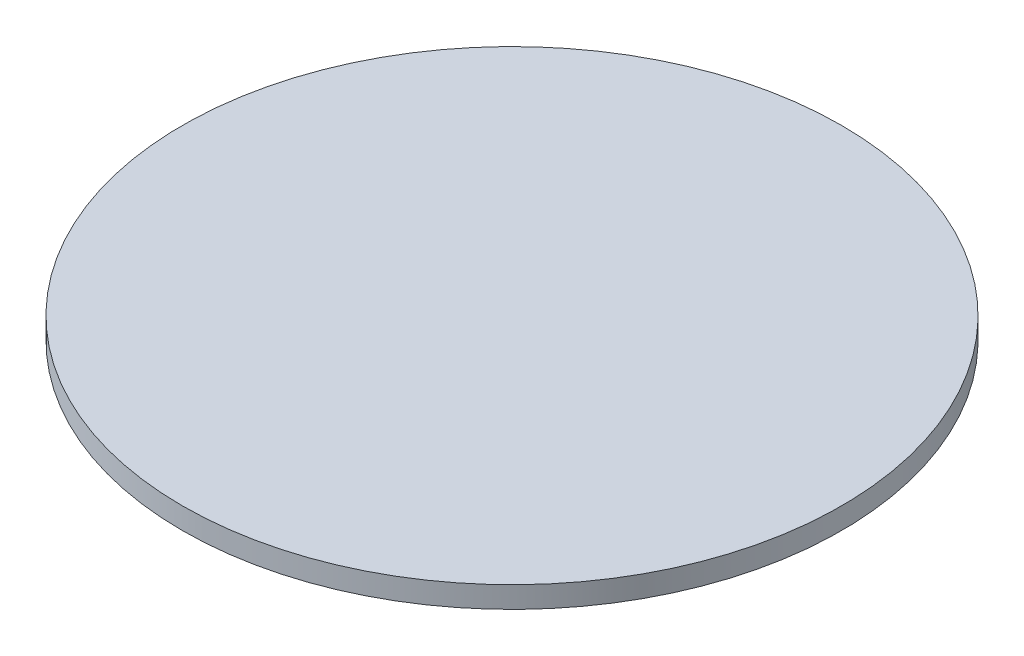
ISO-10303-21;
HEADER;
FILE_DESCRIPTION(('STEP AP214'),'2;1');
FILE_NAME('part.step','',(''),(''),'','','');
FILE_SCHEMA(('AUTOMOTIVE_DESIGN { 1 0 10303 214 1 1 1 1 }'));
ENDSEC;
DATA;
#1=APPLICATION_CONTEXT('core data for automotive mechanical design processes');
#2=APPLICATION_PROTOCOL_DEFINITION('international standard','automotive_design',2000,#1);
#3=PRODUCT_CONTEXT('',#1,'mechanical');
#4=PRODUCT('Part','Part','',(#3));
#5=PRODUCT_RELATED_PRODUCT_CATEGORY('part','',(#4));
#6=PRODUCT_DEFINITION_FORMATION('','',#4);
#7=PRODUCT_DEFINITION_CONTEXT('part definition',#1,'design');
#8=PRODUCT_DEFINITION('design','',#6,#7);
#9=PRODUCT_DEFINITION_SHAPE('','',#8);
#10=(LENGTH_UNIT() NAMED_UNIT(*) SI_UNIT(.MILLI.,.METRE.));
#11=(NAMED_UNIT(*) PLANE_ANGLE_UNIT() SI_UNIT($,.RADIAN.));
#12=(NAMED_UNIT(*) SI_UNIT($,.STERADIAN.) SOLID_ANGLE_UNIT());
#13=UNCERTAINTY_MEASURE_WITH_UNIT(LENGTH_MEASURE(1.E-05),#10,'distance_accuracy_value','');
#14=(GEOMETRIC_REPRESENTATION_CONTEXT(3) GLOBAL_UNCERTAINTY_ASSIGNED_CONTEXT((#13)) GLOBAL_UNIT_ASSIGNED_CONTEXT((#10,
#11,#12)) REPRESENTATION_CONTEXT('',''));
#15=CARTESIAN_POINT('',(0.,0.,0.));
#16=DIRECTION('',(0.,0.,1.));
#17=DIRECTION('',(1.,0.,0.));
#18=AXIS2_PLACEMENT_3D('',#15,#16,#17);
#19=CARTESIAN_POINT('',(0.,9.906,0.));
#20=DIRECTION('',(0.,-1.,0.));
#21=DIRECTION('',(0.,0.,-1.));
#22=AXIS2_PLACEMENT_3D('',#19,#20,#21);
#23=CYLINDRICAL_SURFACE('',#22,152.4);
#24=CARTESIAN_POINT('',(0.,9.906,0.));
#25=DIRECTION('',(0.,1.,0.));
#26=DIRECTION('',(0.,0.,1.));
#27=AXIS2_PLACEMENT_3D('',#24,#25,#26);
#28=CIRCLE('',#27,152.4);
#29=CARTESIAN_POINT('',(0.,9.906,152.4));
#30=VERTEX_POINT('',#29);
#31=EDGE_CURVE('E10',#30,#30,#28,.T.);
#32=ORIENTED_EDGE('',*,*,#31,.F.);
#33=EDGE_LOOP('',(#32));
#34=FACE_BOUND('',#33,.T.);
#35=CARTESIAN_POINT('',(0.,0.,0.));
#36=DIRECTION('',(0.,1.,0.));
#37=DIRECTION('',(0.,0.,1.));
#38=AXIS2_PLACEMENT_3D('',#35,#36,#37);
#39=CIRCLE('',#38,152.4);
#40=CARTESIAN_POINT('',(0.,0.,152.4));
#41=VERTEX_POINT('',#40);
#42=EDGE_CURVE('E40',#41,#41,#39,.T.);
#43=ORIENTED_EDGE('',*,*,#42,.T.);
#44=EDGE_LOOP('',(#43));
#45=FACE_BOUND('',#44,.T.);
#46=ADVANCED_FACE('F37',(#34,#45),#23,.T.);
#47=CARTESIAN_POINT('',(0.,9.906,0.));
#48=DIRECTION('',(0.,1.,0.));
#49=DIRECTION('',(0.,0.,1.));
#50=AXIS2_PLACEMENT_3D('',#47,#48,#49);
#51=PLANE('',#50);
#52=ORIENTED_EDGE('',*,*,#31,.T.);
#53=EDGE_LOOP('',(#52));
#54=FACE_BOUND('',#53,.T.);
#55=ADVANCED_FACE('F54',(#54),#51,.T.);
#56=CARTESIAN_POINT('',(0.,0.,0.));
#57=DIRECTION('',(0.,1.,0.));
#58=DIRECTION('',(0.,0.,1.));
#59=AXIS2_PLACEMENT_3D('',#56,#57,#58);
#60=PLANE('',#59);
#61=ORIENTED_EDGE('',*,*,#42,.F.);
#62=EDGE_LOOP('',(#61));
#63=FACE_BOUND('',#62,.T.);
#64=ADVANCED_FACE('F52',(#63),#60,.F.);
#65=CLOSED_SHELL('',(#46,#55,#64));
#66=MANIFOLD_SOLID_BREP('B2',#65);
#67=ADVANCED_BREP_SHAPE_REPRESENTATION('',(#18,#66),#14);
#68=SHAPE_DEFINITION_REPRESENTATION(#9,#67);
ENDSEC;
END-ISO-10303-21;
